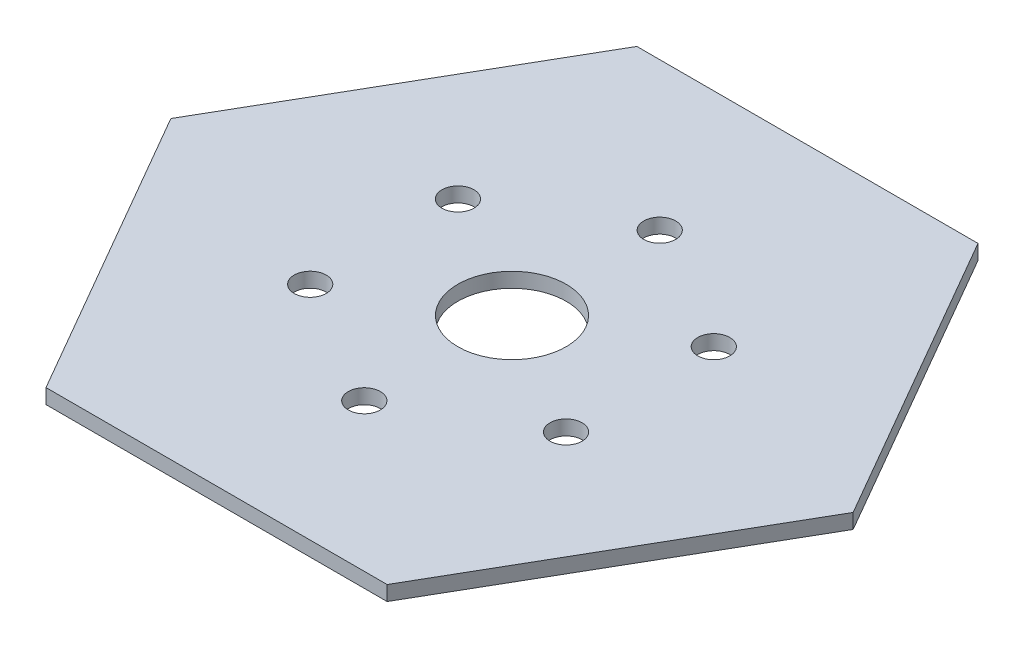
ISO-10303-21;
HEADER;
FILE_DESCRIPTION(('STEP AP214'),'2;1');
FILE_NAME('part.step','',(''),(''),'','','');
FILE_SCHEMA(('AUTOMOTIVE_DESIGN { 1 0 10303 214 1 1 1 1 }'));
ENDSEC;
DATA;
#1=APPLICATION_CONTEXT('core data for automotive mechanical design processes');
#2=APPLICATION_PROTOCOL_DEFINITION('international standard','automotive_design',2000,#1);
#3=PRODUCT_CONTEXT('',#1,'mechanical');
#4=PRODUCT('Part','Part','',(#3));
#5=PRODUCT_RELATED_PRODUCT_CATEGORY('part','',(#4));
#6=PRODUCT_DEFINITION_FORMATION('','',#4);
#7=PRODUCT_DEFINITION_CONTEXT('part definition',#1,'design');
#8=PRODUCT_DEFINITION('design','',#6,#7);
#9=PRODUCT_DEFINITION_SHAPE('','',#8);
#10=(LENGTH_UNIT() NAMED_UNIT(*) SI_UNIT(.MILLI.,.METRE.));
#11=(NAMED_UNIT(*) PLANE_ANGLE_UNIT() SI_UNIT($,.RADIAN.));
#12=(NAMED_UNIT(*) SI_UNIT($,.STERADIAN.) SOLID_ANGLE_UNIT());
#13=UNCERTAINTY_MEASURE_WITH_UNIT(LENGTH_MEASURE(1.E-05),#10,'distance_accuracy_value','');
#14=(GEOMETRIC_REPRESENTATION_CONTEXT(3) GLOBAL_UNCERTAINTY_ASSIGNED_CONTEXT((#13)) GLOBAL_UNIT_ASSIGNED_CONTEXT((#10,
#11,#12)) REPRESENTATION_CONTEXT('',''));
#15=CARTESIAN_POINT('',(0.,0.,0.));
#16=DIRECTION('',(0.,0.,1.));
#17=DIRECTION('',(1.,0.,0.));
#18=AXIS2_PLACEMENT_3D('',#15,#16,#17);
#19=CARTESIAN_POINT('',(0.,3.,0.));
#20=DIRECTION('',(0.,1.,0.));
#21=DIRECTION('',(0.,0.,1.));
#22=AXIS2_PLACEMENT_3D('',#19,#20,#21);
#23=PLANE('',#22);
#24=CARTESIAN_POINT('',(-25.9807621135298,3.,-14.9999999999941));
#25=DIRECTION('',(0.,1.,0.));
#26=DIRECTION('',(0.,0.,1.));
#27=AXIS2_PLACEMENT_3D('',#24,#25,#26);
#28=CIRCLE('',#27,3.25);
#29=CARTESIAN_POINT('',(-25.9807621135298,3.,-11.7499999999941));
#30=VERTEX_POINT('',#29);
#31=EDGE_CURVE('E195',#30,#30,#28,.T.);
#32=ORIENTED_EDGE('',*,*,#31,.F.);
#33=EDGE_LOOP('',(#32));
#34=FACE_BOUND('',#33,.T.);
#35=CARTESIAN_POINT('',(-25.9807621135229,3.,15.0000000000059));
#36=DIRECTION('',(0.,1.,0.));
#37=DIRECTION('',(0.,0.,1.));
#38=AXIS2_PLACEMENT_3D('',#35,#36,#37);
#39=CIRCLE('',#38,3.25);
#40=CARTESIAN_POINT('',(-25.9807621135229,3.,18.2500000000059));
#41=VERTEX_POINT('',#40);
#42=EDGE_CURVE('E197',#41,#41,#39,.T.);
#43=ORIENTED_EDGE('',*,*,#42,.F.);
#44=EDGE_LOOP('',(#43));
#45=FACE_BOUND('',#44,.T.);
#46=CARTESIAN_POINT('',(1.36020071822221E-11,3.,30.));
#47=DIRECTION('',(0.,1.,0.));
#48=DIRECTION('',(0.,0.,1.));
#49=AXIS2_PLACEMENT_3D('',#46,#47,#48);
#50=CIRCLE('',#49,3.25);
#51=CARTESIAN_POINT('',(1.36020071822221E-11,3.,33.25));
#52=VERTEX_POINT('',#51);
#53=EDGE_CURVE('E203',#52,#52,#50,.T.);
#54=ORIENTED_EDGE('',*,*,#53,.F.);
#55=EDGE_LOOP('',(#54));
#56=FACE_BOUND('',#55,.T.);
#57=CARTESIAN_POINT('',(25.9807621135434,3.,14.9999999999941));
#58=DIRECTION('',(0.,1.,0.));
#59=DIRECTION('',(0.,0.,1.));
#60=AXIS2_PLACEMENT_3D('',#57,#58,#59);
#61=CIRCLE('',#60,3.25);
#62=CARTESIAN_POINT('',(25.9807621135434,3.,18.2499999999941));
#63=VERTEX_POINT('',#62);
#64=EDGE_CURVE('E209',#63,#63,#61,.T.);
#65=ORIENTED_EDGE('',*,*,#64,.F.);
#66=EDGE_LOOP('',(#65));
#67=FACE_BOUND('',#66,.T.);
#68=CARTESIAN_POINT('',(25.9807621135365,3.,-15.0000000000059));
#69=DIRECTION('',(0.,1.,0.));
#70=DIRECTION('',(0.,0.,1.));
#71=AXIS2_PLACEMENT_3D('',#68,#69,#70);
#72=CIRCLE('',#71,3.25);
#73=CARTESIAN_POINT('',(25.9807621135365,3.,-11.7500000000059));
#74=VERTEX_POINT('',#73);
#75=EDGE_CURVE('E215',#74,#74,#72,.T.);
#76=ORIENTED_EDGE('',*,*,#75,.F.);
#77=EDGE_LOOP('',(#76));
#78=FACE_BOUND('',#77,.T.);
#79=CARTESIAN_POINT('',(0.,3.,-30.));
#80=DIRECTION('',(0.,1.,0.));
#81=DIRECTION('',(0.,0.,1.));
#82=AXIS2_PLACEMENT_3D('',#79,#80,#81);
#83=CIRCLE('',#82,3.25);
#84=CARTESIAN_POINT('',(0.,3.,-26.75));
#85=VERTEX_POINT('',#84);
#86=EDGE_CURVE('E221',#85,#85,#83,.T.);
#87=ORIENTED_EDGE('',*,*,#86,.F.);
#88=EDGE_LOOP('',(#87));
#89=FACE_BOUND('',#88,.T.);
#90=DIRECTION('',(0.499999999999999,0.,-0.866025403784439));
#91=VECTOR('',#90,1.);
#92=CARTESIAN_POINT('',(34.6410161513776,3.,60.));
#93=LINE('',#92,#91);
#94=CARTESIAN_POINT('',(34.6410161513776,3.,60.));
#95=VERTEX_POINT('',#94);
#96=CARTESIAN_POINT('',(69.2820323027551,3.,0.));
#97=VERTEX_POINT('',#96);
#98=EDGE_CURVE('E129',#95,#97,#93,.T.);
#99=ORIENTED_EDGE('',*,*,#98,.T.);
#100=DIRECTION('',(-0.5,0.,-0.866025403784438));
#101=VECTOR('',#100,1.);
#102=CARTESIAN_POINT('',(69.2820323027551,3.,0.));
#103=LINE('',#102,#101);
#104=CARTESIAN_POINT('',(34.6410161513775,3.,-60.));
#105=VERTEX_POINT('',#104);
#106=EDGE_CURVE('E87',#97,#105,#103,.T.);
#107=ORIENTED_EDGE('',*,*,#106,.T.);
#108=DIRECTION('',(-1.,0.,0.));
#109=VECTOR('',#108,1.);
#110=CARTESIAN_POINT('',(34.6410161513775,3.,-60.));
#111=LINE('',#110,#109);
#112=CARTESIAN_POINT('',(-34.6410161513775,3.,-60.));
#113=VERTEX_POINT('',#112);
#114=EDGE_CURVE('E100',#105,#113,#111,.T.);
#115=ORIENTED_EDGE('',*,*,#114,.T.);
#116=DIRECTION('',(-0.5,0.,0.866025403784439));
#117=VECTOR('',#116,1.);
#118=CARTESIAN_POINT('',(-34.6410161513775,3.,-60.));
#119=LINE('',#118,#117);
#120=CARTESIAN_POINT('',(-69.2820323027551,3.,0.));
#121=VERTEX_POINT('',#120);
#122=EDGE_CURVE('E94',#113,#121,#119,.T.);
#123=ORIENTED_EDGE('',*,*,#122,.T.);
#124=DIRECTION('',(0.5,0.,0.866025403784439));
#125=VECTOR('',#124,1.);
#126=CARTESIAN_POINT('',(-69.2820323027551,3.,0.));
#127=LINE('',#126,#125);
#128=CARTESIAN_POINT('',(-34.6410161513775,3.,60.));
#129=VERTEX_POINT('',#128);
#130=EDGE_CURVE('E98',#121,#129,#127,.T.);
#131=ORIENTED_EDGE('',*,*,#130,.T.);
#132=DIRECTION('',(1.,0.,0.));
#133=VECTOR('',#132,1.);
#134=CARTESIAN_POINT('',(-34.6410161513775,3.,60.));
#135=LINE('',#134,#133);
#136=EDGE_CURVE('E50',#129,#95,#135,.T.);
#137=ORIENTED_EDGE('',*,*,#136,.T.);
#138=EDGE_LOOP('',(#99,#107,#115,#123,#131,#137));
#139=FACE_BOUND('',#138,.T.);
#140=CARTESIAN_POINT('',(0.,3.,0.));
#141=DIRECTION('',(0.,1.,0.));
#142=DIRECTION('',(0.,0.,1.));
#143=AXIS2_PLACEMENT_3D('',#140,#141,#142);
#144=CIRCLE('',#143,11.);
#145=CARTESIAN_POINT('',(0.,3.,11.));
#146=VERTEX_POINT('',#145);
#147=EDGE_CURVE('E122',#146,#146,#144,.T.);
#148=ORIENTED_EDGE('',*,*,#147,.F.);
#149=EDGE_LOOP('',(#148));
#150=FACE_BOUND('',#149,.T.);
#151=ADVANCED_FACE('F33',(#34,#45,#56,#67,#78,#89,#139,#150),#23,.T.);
#152=CARTESIAN_POINT('',(0.,0.,0.));
#153=DIRECTION('',(0.,1.,0.));
#154=DIRECTION('',(0.,0.,1.));
#155=AXIS2_PLACEMENT_3D('',#152,#153,#154);
#156=PLANE('',#155);
#157=CARTESIAN_POINT('',(-25.9807621135298,0.,-14.9999999999941));
#158=DIRECTION('',(0.,1.,0.));
#159=DIRECTION('',(0.,0.,1.));
#160=AXIS2_PLACEMENT_3D('',#157,#158,#159);
#161=CIRCLE('',#160,3.25);
#162=CARTESIAN_POINT('',(-25.9807621135298,0.,-11.7499999999941));
#163=VERTEX_POINT('',#162);
#164=EDGE_CURVE('E193',#163,#163,#161,.T.);
#165=ORIENTED_EDGE('',*,*,#164,.T.);
#166=EDGE_LOOP('',(#165));
#167=FACE_BOUND('',#166,.T.);
#168=CARTESIAN_POINT('',(-25.9807621135229,0.,15.0000000000059));
#169=DIRECTION('',(0.,1.,0.));
#170=DIRECTION('',(0.,0.,1.));
#171=AXIS2_PLACEMENT_3D('',#168,#169,#170);
#172=CIRCLE('',#171,3.25);
#173=CARTESIAN_POINT('',(-25.9807621135229,0.,18.2500000000059));
#174=VERTEX_POINT('',#173);
#175=EDGE_CURVE('E200',#174,#174,#172,.T.);
#176=ORIENTED_EDGE('',*,*,#175,.T.);
#177=EDGE_LOOP('',(#176));
#178=FACE_BOUND('',#177,.T.);
#179=CARTESIAN_POINT('',(1.36020071822221E-11,0.,30.));
#180=DIRECTION('',(0.,1.,0.));
#181=DIRECTION('',(0.,0.,1.));
#182=AXIS2_PLACEMENT_3D('',#179,#180,#181);
#183=CIRCLE('',#182,3.25);
#184=CARTESIAN_POINT('',(1.36020071822221E-11,0.,33.25));
#185=VERTEX_POINT('',#184);
#186=EDGE_CURVE('E206',#185,#185,#183,.T.);
#187=ORIENTED_EDGE('',*,*,#186,.T.);
#188=EDGE_LOOP('',(#187));
#189=FACE_BOUND('',#188,.T.);
#190=CARTESIAN_POINT('',(25.9807621135434,0.,14.9999999999941));
#191=DIRECTION('',(0.,1.,0.));
#192=DIRECTION('',(0.,0.,1.));
#193=AXIS2_PLACEMENT_3D('',#190,#191,#192);
#194=CIRCLE('',#193,3.25);
#195=CARTESIAN_POINT('',(25.9807621135434,0.,18.2499999999941));
#196=VERTEX_POINT('',#195);
#197=EDGE_CURVE('E212',#196,#196,#194,.T.);
#198=ORIENTED_EDGE('',*,*,#197,.T.);
#199=EDGE_LOOP('',(#198));
#200=FACE_BOUND('',#199,.T.);
#201=CARTESIAN_POINT('',(25.9807621135365,0.,-15.0000000000059));
#202=DIRECTION('',(0.,1.,0.));
#203=DIRECTION('',(0.,0.,1.));
#204=AXIS2_PLACEMENT_3D('',#201,#202,#203);
#205=CIRCLE('',#204,3.25);
#206=CARTESIAN_POINT('',(25.9807621135365,0.,-11.7500000000059));
#207=VERTEX_POINT('',#206);
#208=EDGE_CURVE('E218',#207,#207,#205,.T.);
#209=ORIENTED_EDGE('',*,*,#208,.T.);
#210=EDGE_LOOP('',(#209));
#211=FACE_BOUND('',#210,.T.);
#212=CARTESIAN_POINT('',(0.,0.,-30.));
#213=DIRECTION('',(0.,1.,0.));
#214=DIRECTION('',(0.,0.,1.));
#215=AXIS2_PLACEMENT_3D('',#212,#213,#214);
#216=CIRCLE('',#215,3.25);
#217=CARTESIAN_POINT('',(0.,0.,-26.75));
#218=VERTEX_POINT('',#217);
#219=EDGE_CURVE('E224',#218,#218,#216,.T.);
#220=ORIENTED_EDGE('',*,*,#219,.T.);
#221=EDGE_LOOP('',(#220));
#222=FACE_BOUND('',#221,.T.);
#223=DIRECTION('',(0.499999999999999,0.,-0.866025403784439));
#224=VECTOR('',#223,1.);
#225=CARTESIAN_POINT('',(34.6410161513776,0.,60.));
#226=LINE('',#225,#224);
#227=CARTESIAN_POINT('',(34.6410161513776,0.,60.));
#228=VERTEX_POINT('',#227);
#229=CARTESIAN_POINT('',(69.2820323027551,0.,0.));
#230=VERTEX_POINT('',#229);
#231=EDGE_CURVE('E118',#228,#230,#226,.T.);
#232=ORIENTED_EDGE('',*,*,#231,.F.);
#233=DIRECTION('',(1.,0.,0.));
#234=VECTOR('',#233,1.);
#235=CARTESIAN_POINT('',(-34.6410161513775,0.,60.));
#236=LINE('',#235,#234);
#237=CARTESIAN_POINT('',(-34.6410161513775,0.,60.));
#238=VERTEX_POINT('',#237);
#239=EDGE_CURVE('E79',#238,#228,#236,.T.);
#240=ORIENTED_EDGE('',*,*,#239,.F.);
#241=DIRECTION('',(0.5,0.,0.866025403784439));
#242=VECTOR('',#241,1.);
#243=CARTESIAN_POINT('',(-69.2820323027551,0.,0.));
#244=LINE('',#243,#242);
#245=CARTESIAN_POINT('',(-69.2820323027551,0.,0.));
#246=VERTEX_POINT('',#245);
#247=EDGE_CURVE('E73',#246,#238,#244,.T.);
#248=ORIENTED_EDGE('',*,*,#247,.F.);
#249=DIRECTION('',(-0.5,0.,0.866025403784439));
#250=VECTOR('',#249,1.);
#251=CARTESIAN_POINT('',(-34.6410161513775,0.,-60.));
#252=LINE('',#251,#250);
#253=CARTESIAN_POINT('',(-34.6410161513775,0.,-60.));
#254=VERTEX_POINT('',#253);
#255=EDGE_CURVE('E108',#254,#246,#252,.T.);
#256=ORIENTED_EDGE('',*,*,#255,.F.);
#257=DIRECTION('',(-1.,0.,0.));
#258=VECTOR('',#257,1.);
#259=CARTESIAN_POINT('',(34.6410161513775,0.,-60.));
#260=LINE('',#259,#258);
#261=CARTESIAN_POINT('',(34.6410161513775,0.,-60.));
#262=VERTEX_POINT('',#261);
#263=EDGE_CURVE('E124',#262,#254,#260,.T.);
#264=ORIENTED_EDGE('',*,*,#263,.F.);
#265=DIRECTION('',(-0.5,0.,-0.866025403784438));
#266=VECTOR('',#265,1.);
#267=CARTESIAN_POINT('',(69.2820323027551,0.,0.));
#268=LINE('',#267,#266);
#269=EDGE_CURVE('E121',#230,#262,#268,.T.);
#270=ORIENTED_EDGE('',*,*,#269,.F.);
#271=EDGE_LOOP('',(#232,#240,#248,#256,#264,#270));
#272=FACE_BOUND('',#271,.T.);
#273=CARTESIAN_POINT('',(0.,0.,0.));
#274=DIRECTION('',(0.,1.,0.));
#275=DIRECTION('',(0.,0.,1.));
#276=AXIS2_PLACEMENT_3D('',#273,#274,#275);
#277=CIRCLE('',#276,11.);
#278=CARTESIAN_POINT('',(0.,0.,11.));
#279=VERTEX_POINT('',#278);
#280=EDGE_CURVE('E227',#279,#279,#277,.T.);
#281=ORIENTED_EDGE('',*,*,#280,.T.);
#282=EDGE_LOOP('',(#281));
#283=FACE_BOUND('',#282,.T.);
#284=ADVANCED_FACE('F138',(#167,#178,#189,#200,#211,#222,#272,#283),#156,.F.);
#285=CARTESIAN_POINT('',(34.6410161513776,3.,60.));
#286=DIRECTION('',(-0.866025403784439,0.,-0.5));
#287=DIRECTION('',(-0.5,0.,0.866025403784439));
#288=AXIS2_PLACEMENT_3D('',#285,#286,#287);
#289=PLANE('',#288);
#290=ORIENTED_EDGE('',*,*,#231,.T.);
#291=DIRECTION('',(0.,-1.,0.));
#292=VECTOR('',#291,1.);
#293=CARTESIAN_POINT('',(69.2820323027551,3.,0.));
#294=LINE('',#293,#292);
#295=EDGE_CURVE('E11',#97,#230,#294,.T.);
#296=ORIENTED_EDGE('',*,*,#295,.F.);
#297=ORIENTED_EDGE('',*,*,#98,.F.);
#298=DIRECTION('',(0.,-1.,0.));
#299=VECTOR('',#298,1.);
#300=CARTESIAN_POINT('',(34.6410161513776,3.,60.));
#301=LINE('',#300,#299);
#302=EDGE_CURVE('E114',#95,#228,#301,.T.);
#303=ORIENTED_EDGE('',*,*,#302,.T.);
#304=EDGE_LOOP('',(#290,#296,#297,#303));
#305=FACE_BOUND('',#304,.T.);
#306=ADVANCED_FACE('F35',(#305),#289,.F.);
#307=CARTESIAN_POINT('',(69.2820323027551,3.,0.));
#308=DIRECTION('',(-0.866025403784439,0.,0.5));
#309=DIRECTION('',(0.5,0.,0.866025403784439));
#310=AXIS2_PLACEMENT_3D('',#307,#308,#309);
#311=PLANE('',#310);
#312=ORIENTED_EDGE('',*,*,#269,.T.);
#313=DIRECTION('',(0.,-1.,0.));
#314=VECTOR('',#313,1.);
#315=CARTESIAN_POINT('',(34.6410161513775,3.,-60.));
#316=LINE('',#315,#314);
#317=EDGE_CURVE('E42',#105,#262,#316,.T.);
#318=ORIENTED_EDGE('',*,*,#317,.F.);
#319=ORIENTED_EDGE('',*,*,#106,.F.);
#320=ORIENTED_EDGE('',*,*,#295,.T.);
#321=EDGE_LOOP('',(#312,#318,#319,#320));
#322=FACE_BOUND('',#321,.T.);
#323=ADVANCED_FACE('F308',(#322),#311,.F.);
#324=CARTESIAN_POINT('',(34.6410161513775,3.,-60.));
#325=DIRECTION('',(0.,0.,1.));
#326=DIRECTION('',(1.,0.,0.));
#327=AXIS2_PLACEMENT_3D('',#324,#325,#326);
#328=PLANE('',#327);
#329=ORIENTED_EDGE('',*,*,#263,.T.);
#330=DIRECTION('',(0.,-1.,0.));
#331=VECTOR('',#330,1.);
#332=CARTESIAN_POINT('',(-34.6410161513775,3.,-60.));
#333=LINE('',#332,#331);
#334=EDGE_CURVE('E109',#113,#254,#333,.T.);
#335=ORIENTED_EDGE('',*,*,#334,.F.);
#336=ORIENTED_EDGE('',*,*,#114,.F.);
#337=ORIENTED_EDGE('',*,*,#317,.T.);
#338=EDGE_LOOP('',(#329,#335,#336,#337));
#339=FACE_BOUND('',#338,.T.);
#340=ADVANCED_FACE('F135',(#339),#328,.F.);
#341=CARTESIAN_POINT('',(-34.6410161513775,3.,-60.));
#342=DIRECTION('',(0.866025403784439,0.,0.5));
#343=DIRECTION('',(0.5,0.,-0.866025403784439));
#344=AXIS2_PLACEMENT_3D('',#341,#342,#343);
#345=PLANE('',#344);
#346=ORIENTED_EDGE('',*,*,#255,.T.);
#347=DIRECTION('',(0.,-1.,0.));
#348=VECTOR('',#347,1.);
#349=CARTESIAN_POINT('',(-69.2820323027551,3.,0.));
#350=LINE('',#349,#348);
#351=EDGE_CURVE('E105',#121,#246,#350,.T.);
#352=ORIENTED_EDGE('',*,*,#351,.F.);
#353=ORIENTED_EDGE('',*,*,#122,.F.);
#354=ORIENTED_EDGE('',*,*,#334,.T.);
#355=EDGE_LOOP('',(#346,#352,#353,#354));
#356=FACE_BOUND('',#355,.T.);
#357=ADVANCED_FACE('F106',(#356),#345,.F.);
#358=CARTESIAN_POINT('',(-69.2820323027551,3.,0.));
#359=DIRECTION('',(0.866025403784439,0.,-0.5));
#360=DIRECTION('',(-0.5,0.,-0.866025403784439));
#361=AXIS2_PLACEMENT_3D('',#358,#359,#360);
#362=PLANE('',#361);
#363=ORIENTED_EDGE('',*,*,#247,.T.);
#364=DIRECTION('',(0.,-1.,0.));
#365=VECTOR('',#364,1.);
#366=CARTESIAN_POINT('',(-34.6410161513775,3.,60.));
#367=LINE('',#366,#365);
#368=EDGE_CURVE('E110',#129,#238,#367,.T.);
#369=ORIENTED_EDGE('',*,*,#368,.F.);
#370=ORIENTED_EDGE('',*,*,#130,.F.);
#371=ORIENTED_EDGE('',*,*,#351,.T.);
#372=EDGE_LOOP('',(#363,#369,#370,#371));
#373=FACE_BOUND('',#372,.T.);
#374=ADVANCED_FACE('F112',(#373),#362,.F.);
#375=CARTESIAN_POINT('',(-34.6410161513775,3.,60.));
#376=DIRECTION('',(0.,0.,-1.));
#377=DIRECTION('',(-1.,0.,0.));
#378=AXIS2_PLACEMENT_3D('',#375,#376,#377);
#379=PLANE('',#378);
#380=ORIENTED_EDGE('',*,*,#239,.T.);
#381=ORIENTED_EDGE('',*,*,#302,.F.);
#382=ORIENTED_EDGE('',*,*,#136,.F.);
#383=ORIENTED_EDGE('',*,*,#368,.T.);
#384=EDGE_LOOP('',(#380,#381,#382,#383));
#385=FACE_BOUND('',#384,.T.);
#386=ADVANCED_FACE('F143',(#385),#379,.F.);
#387=CARTESIAN_POINT('',(0.,3.,0.));
#388=DIRECTION('',(0.,-1.,0.));
#389=DIRECTION('',(0.,0.,-1.));
#390=AXIS2_PLACEMENT_3D('',#387,#388,#389);
#391=CYLINDRICAL_SURFACE('',#390,11.);
#392=ORIENTED_EDGE('',*,*,#147,.T.);
#393=EDGE_LOOP('',(#392));
#394=FACE_BOUND('',#393,.T.);
#395=ORIENTED_EDGE('',*,*,#280,.F.);
#396=EDGE_LOOP('',(#395));
#397=FACE_BOUND('',#396,.T.);
#398=ADVANCED_FACE('F145',(#394,#397),#391,.F.);
#399=CARTESIAN_POINT('',(0.,0.,-30.));
#400=DIRECTION('',(0.,1.,0.));
#401=DIRECTION('',(0.,0.,1.));
#402=AXIS2_PLACEMENT_3D('',#399,#400,#401);
#403=CYLINDRICAL_SURFACE('',#402,3.25);
#404=ORIENTED_EDGE('',*,*,#219,.F.);
#405=EDGE_LOOP('',(#404));
#406=FACE_BOUND('',#405,.T.);
#407=ORIENTED_EDGE('',*,*,#86,.T.);
#408=EDGE_LOOP('',(#407));
#409=FACE_BOUND('',#408,.T.);
#410=ADVANCED_FACE('F151',(#406,#409),#403,.F.);
#411=CARTESIAN_POINT('',(25.9807621135365,0.,-15.0000000000059));
#412=DIRECTION('',(0.,1.,0.));
#413=DIRECTION('',(0.,0.,1.));
#414=AXIS2_PLACEMENT_3D('',#411,#412,#413);
#415=CYLINDRICAL_SURFACE('',#414,3.25);
#416=ORIENTED_EDGE('',*,*,#208,.F.);
#417=EDGE_LOOP('',(#416));
#418=FACE_BOUND('',#417,.T.);
#419=ORIENTED_EDGE('',*,*,#75,.T.);
#420=EDGE_LOOP('',(#419));
#421=FACE_BOUND('',#420,.T.);
#422=ADVANCED_FACE('F168',(#418,#421),#415,.F.);
#423=CARTESIAN_POINT('',(25.9807621135434,0.,14.9999999999941));
#424=DIRECTION('',(0.,1.,0.));
#425=DIRECTION('',(0.,0.,1.));
#426=AXIS2_PLACEMENT_3D('',#423,#424,#425);
#427=CYLINDRICAL_SURFACE('',#426,3.25);
#428=ORIENTED_EDGE('',*,*,#197,.F.);
#429=EDGE_LOOP('',(#428));
#430=FACE_BOUND('',#429,.T.);
#431=ORIENTED_EDGE('',*,*,#64,.T.);
#432=EDGE_LOOP('',(#431));
#433=FACE_BOUND('',#432,.T.);
#434=ADVANCED_FACE('F172',(#430,#433),#427,.F.);
#435=CARTESIAN_POINT('',(1.36020071822221E-11,0.,30.));
#436=DIRECTION('',(0.,1.,0.));
#437=DIRECTION('',(0.,0.,1.));
#438=AXIS2_PLACEMENT_3D('',#435,#436,#437);
#439=CYLINDRICAL_SURFACE('',#438,3.25);
#440=ORIENTED_EDGE('',*,*,#186,.F.);
#441=EDGE_LOOP('',(#440));
#442=FACE_BOUND('',#441,.T.);
#443=ORIENTED_EDGE('',*,*,#53,.T.);
#444=EDGE_LOOP('',(#443));
#445=FACE_BOUND('',#444,.T.);
#446=ADVANCED_FACE('F176',(#442,#445),#439,.F.);
#447=CARTESIAN_POINT('',(-25.9807621135229,0.,15.0000000000059));
#448=DIRECTION('',(0.,1.,0.));
#449=DIRECTION('',(0.,0.,1.));
#450=AXIS2_PLACEMENT_3D('',#447,#448,#449);
#451=CYLINDRICAL_SURFACE('',#450,3.25);
#452=ORIENTED_EDGE('',*,*,#175,.F.);
#453=EDGE_LOOP('',(#452));
#454=FACE_BOUND('',#453,.T.);
#455=ORIENTED_EDGE('',*,*,#42,.T.);
#456=EDGE_LOOP('',(#455));
#457=FACE_BOUND('',#456,.T.);
#458=ADVANCED_FACE('F180',(#454,#457),#451,.F.);
#459=CARTESIAN_POINT('',(-25.9807621135298,0.,-14.9999999999941));
#460=DIRECTION('',(0.,1.,0.));
#461=DIRECTION('',(0.,0.,1.));
#462=AXIS2_PLACEMENT_3D('',#459,#460,#461);
#463=CYLINDRICAL_SURFACE('',#462,3.25);
#464=ORIENTED_EDGE('',*,*,#164,.F.);
#465=EDGE_LOOP('',(#464));
#466=FACE_BOUND('',#465,.T.);
#467=ORIENTED_EDGE('',*,*,#31,.T.);
#468=EDGE_LOOP('',(#467));
#469=FACE_BOUND('',#468,.T.);
#470=ADVANCED_FACE('F184',(#466,#469),#463,.F.);
#471=CLOSED_SHELL('',(#151,#284,#306,#323,#340,#357,#374,#386,#398,#410,#422,#434,#446,#458,#470));
#472=MANIFOLD_SOLID_BREP('B2',#471);
#473=ADVANCED_BREP_SHAPE_REPRESENTATION('',(#18,#472),#14);
#474=SHAPE_DEFINITION_REPRESENTATION(#9,#473);
ENDSEC;
END-ISO-10303-21;
